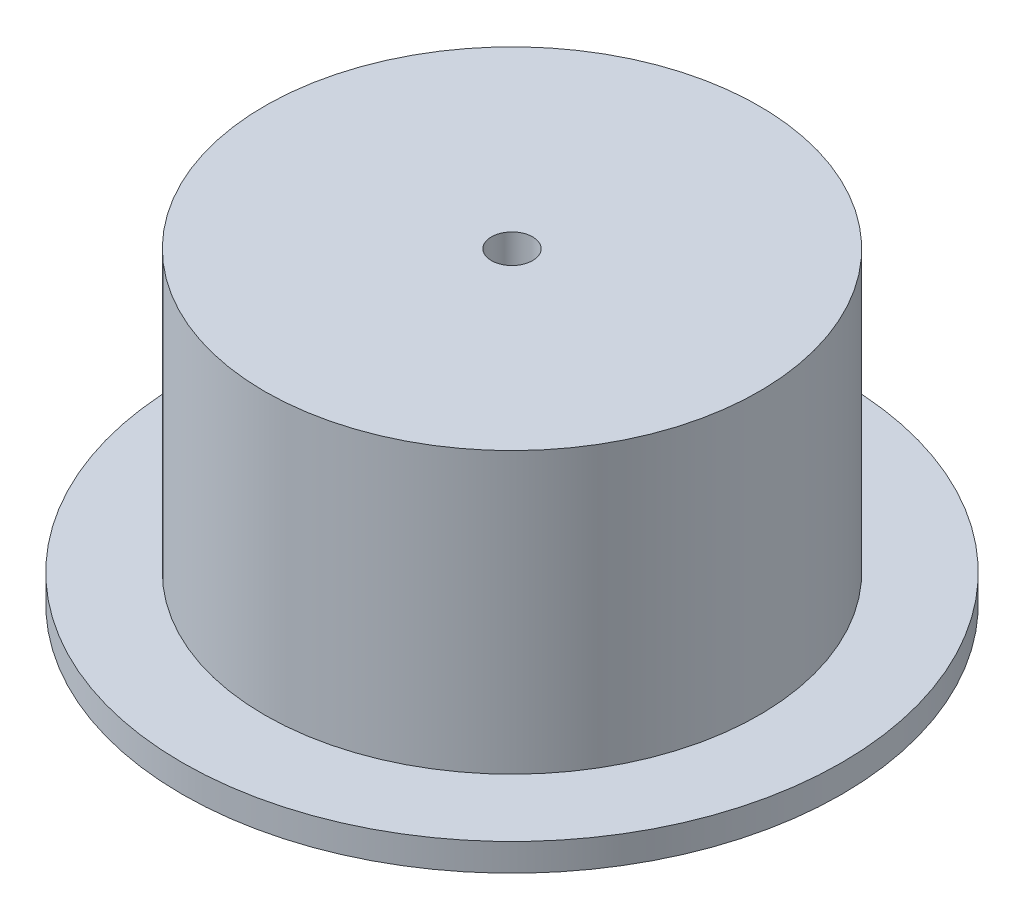
ISO-10303-21;
HEADER;
FILE_DESCRIPTION(('STEP AP214'),'2;1');
FILE_NAME('part.step','',(''),(''),'','','');
FILE_SCHEMA(('AUTOMOTIVE_DESIGN { 1 0 10303 214 1 1 1 1 }'));
ENDSEC;
DATA;
#1=APPLICATION_CONTEXT('core data for automotive mechanical design processes');
#2=APPLICATION_PROTOCOL_DEFINITION('international standard','automotive_design',2000,#1);
#3=PRODUCT_CONTEXT('',#1,'mechanical');
#4=PRODUCT('Part','Part','',(#3));
#5=PRODUCT_RELATED_PRODUCT_CATEGORY('part','',(#4));
#6=PRODUCT_DEFINITION_FORMATION('','',#4);
#7=PRODUCT_DEFINITION_CONTEXT('part definition',#1,'design');
#8=PRODUCT_DEFINITION('design','',#6,#7);
#9=PRODUCT_DEFINITION_SHAPE('','',#8);
#10=(LENGTH_UNIT() NAMED_UNIT(*) SI_UNIT(.MILLI.,.METRE.));
#11=(NAMED_UNIT(*) PLANE_ANGLE_UNIT() SI_UNIT($,.RADIAN.));
#12=(NAMED_UNIT(*) SI_UNIT($,.STERADIAN.) SOLID_ANGLE_UNIT());
#13=UNCERTAINTY_MEASURE_WITH_UNIT(LENGTH_MEASURE(1.E-05),#10,'distance_accuracy_value','');
#14=(GEOMETRIC_REPRESENTATION_CONTEXT(3) GLOBAL_UNCERTAINTY_ASSIGNED_CONTEXT((#13)) GLOBAL_UNIT_ASSIGNED_CONTEXT((#10,
#11,#12)) REPRESENTATION_CONTEXT('',''));
#15=CARTESIAN_POINT('',(0.,0.,0.));
#16=DIRECTION('',(0.,0.,1.));
#17=DIRECTION('',(1.,0.,0.));
#18=AXIS2_PLACEMENT_3D('',#15,#16,#17);
#19=CARTESIAN_POINT('',(0.,56.,0.));
#20=DIRECTION('',(0.,-1.,0.));
#21=DIRECTION('',(0.,0.,-1.));
#22=AXIS2_PLACEMENT_3D('',#19,#20,#21);
#23=CYLINDRICAL_SURFACE('',#22,40.);
#24=CARTESIAN_POINT('',(0.,0.,0.));
#25=DIRECTION('',(0.,1.,0.));
#26=DIRECTION('',(0.,0.,1.));
#27=AXIS2_PLACEMENT_3D('',#24,#25,#26);
#28=CIRCLE('',#27,40.);
#29=CARTESIAN_POINT('',(0.,0.,40.));
#30=VERTEX_POINT('',#29);
#31=EDGE_CURVE('E48',#30,#30,#28,.T.);
#32=ORIENTED_EDGE('',*,*,#31,.F.);
#33=EDGE_LOOP('',(#32));
#34=FACE_BOUND('',#33,.T.);
#35=CARTESIAN_POINT('',(0.,46.,0.));
#36=DIRECTION('',(0.,1.,0.));
#37=DIRECTION('',(0.,0.,1.));
#38=AXIS2_PLACEMENT_3D('',#35,#36,#37);
#39=CIRCLE('',#38,40.);
#40=CARTESIAN_POINT('',(0.,46.,40.));
#41=VERTEX_POINT('',#40);
#42=EDGE_CURVE('E51',#41,#41,#39,.T.);
#43=ORIENTED_EDGE('',*,*,#42,.T.);
#44=EDGE_LOOP('',(#43));
#45=FACE_BOUND('',#44,.T.);
#46=ADVANCED_FACE('F30',(#34,#45),#23,.F.);
#47=CARTESIAN_POINT('',(0.,5.,0.));
#48=DIRECTION('',(0.,1.,0.));
#49=DIRECTION('',(0.,0.,1.));
#50=AXIS2_PLACEMENT_3D('',#47,#48,#49);
#51=PLANE('',#50);
#52=CARTESIAN_POINT('',(0.,5.,0.));
#53=DIRECTION('',(0.,1.,0.));
#54=DIRECTION('',(0.,0.,1.));
#55=AXIS2_PLACEMENT_3D('',#52,#53,#54);
#56=CIRCLE('',#55,60.);
#57=CARTESIAN_POINT('',(0.,5.,60.));
#58=VERTEX_POINT('',#57);
#59=EDGE_CURVE('E10',#58,#58,#56,.T.);
#60=ORIENTED_EDGE('',*,*,#59,.T.);
#61=EDGE_LOOP('',(#60));
#62=FACE_BOUND('',#61,.T.);
#63=CARTESIAN_POINT('',(0.,5.,0.));
#64=DIRECTION('',(0.,1.,0.));
#65=DIRECTION('',(0.,0.,1.));
#66=AXIS2_PLACEMENT_3D('',#63,#64,#65);
#67=CIRCLE('',#66,45.);
#68=CARTESIAN_POINT('',(0.,5.,45.));
#69=VERTEX_POINT('',#68);
#70=EDGE_CURVE('E41',#69,#69,#67,.T.);
#71=ORIENTED_EDGE('',*,*,#70,.F.);
#72=EDGE_LOOP('',(#71));
#73=FACE_BOUND('',#72,.T.);
#74=ADVANCED_FACE('F85',(#62,#73),#51,.T.);
#75=CARTESIAN_POINT('',(0.,0.,0.));
#76=DIRECTION('',(0.,1.,0.));
#77=DIRECTION('',(0.,0.,1.));
#78=AXIS2_PLACEMENT_3D('',#75,#76,#77);
#79=PLANE('',#78);
#80=CARTESIAN_POINT('',(0.,0.,0.));
#81=DIRECTION('',(0.,1.,0.));
#82=DIRECTION('',(0.,0.,1.));
#83=AXIS2_PLACEMENT_3D('',#80,#81,#82);
#84=CIRCLE('',#83,60.);
#85=CARTESIAN_POINT('',(0.,0.,60.));
#86=VERTEX_POINT('',#85);
#87=EDGE_CURVE('E34',#86,#86,#84,.T.);
#88=ORIENTED_EDGE('',*,*,#87,.F.);
#89=EDGE_LOOP('',(#88));
#90=FACE_BOUND('',#89,.T.);
#91=ORIENTED_EDGE('',*,*,#31,.T.);
#92=EDGE_LOOP('',(#91));
#93=FACE_BOUND('',#92,.T.);
#94=ADVANCED_FACE('F81',(#90,#93),#79,.F.);
#95=CARTESIAN_POINT('',(0.,5.,0.));
#96=DIRECTION('',(0.,-1.,0.));
#97=DIRECTION('',(0.,0.,-1.));
#98=AXIS2_PLACEMENT_3D('',#95,#96,#97);
#99=CYLINDRICAL_SURFACE('',#98,60.);
#100=ORIENTED_EDGE('',*,*,#59,.F.);
#101=EDGE_LOOP('',(#100));
#102=FACE_BOUND('',#101,.T.);
#103=ORIENTED_EDGE('',*,*,#87,.T.);
#104=EDGE_LOOP('',(#103));
#105=FACE_BOUND('',#104,.T.);
#106=ADVANCED_FACE('F32',(#102,#105),#99,.T.);
#107=CARTESIAN_POINT('',(0.,56.,0.));
#108=DIRECTION('',(0.,1.,0.));
#109=DIRECTION('',(0.,0.,1.));
#110=AXIS2_PLACEMENT_3D('',#107,#108,#109);
#111=PLANE('',#110);
#112=CARTESIAN_POINT('',(0.,56.,0.));
#113=DIRECTION('',(0.,1.,0.));
#114=DIRECTION('',(0.,0.,1.));
#115=AXIS2_PLACEMENT_3D('',#112,#113,#114);
#116=CIRCLE('',#115,45.);
#117=CARTESIAN_POINT('',(0.,56.,45.));
#118=VERTEX_POINT('',#117);
#119=EDGE_CURVE('E45',#118,#118,#116,.T.);
#120=ORIENTED_EDGE('',*,*,#119,.T.);
#121=EDGE_LOOP('',(#120));
#122=FACE_BOUND('',#121,.T.);
#123=CARTESIAN_POINT('',(0.,56.,0.));
#124=DIRECTION('',(0.,1.,0.));
#125=DIRECTION('',(0.,0.,1.));
#126=AXIS2_PLACEMENT_3D('',#123,#124,#125);
#127=CIRCLE('',#126,3.75);
#128=CARTESIAN_POINT('',(0.,56.,3.75));
#129=VERTEX_POINT('',#128);
#130=EDGE_CURVE('E55',#129,#129,#127,.T.);
#131=ORIENTED_EDGE('',*,*,#130,.F.);
#132=EDGE_LOOP('',(#131));
#133=FACE_BOUND('',#132,.T.);
#134=ADVANCED_FACE('F70',(#122,#133),#111,.T.);
#135=CARTESIAN_POINT('',(0.,56.,0.));
#136=DIRECTION('',(0.,-1.,0.));
#137=DIRECTION('',(0.,0.,-1.));
#138=AXIS2_PLACEMENT_3D('',#135,#136,#137);
#139=CYLINDRICAL_SURFACE('',#138,45.);
#140=ORIENTED_EDGE('',*,*,#70,.T.);
#141=EDGE_LOOP('',(#140));
#142=FACE_BOUND('',#141,.T.);
#143=ORIENTED_EDGE('',*,*,#119,.F.);
#144=EDGE_LOOP('',(#143));
#145=FACE_BOUND('',#144,.T.);
#146=ADVANCED_FACE('F72',(#142,#145),#139,.T.);
#147=CARTESIAN_POINT('',(0.,46.,0.));
#148=DIRECTION('',(0.,1.,0.));
#149=DIRECTION('',(0.,0.,1.));
#150=AXIS2_PLACEMENT_3D('',#147,#148,#149);
#151=PLANE('',#150);
#152=CARTESIAN_POINT('',(0.,46.,0.));
#153=DIRECTION('',(0.,1.,0.));
#154=DIRECTION('',(0.,0.,1.));
#155=AXIS2_PLACEMENT_3D('',#152,#153,#154);
#156=CIRCLE('',#155,3.75);
#157=CARTESIAN_POINT('',(0.,46.,3.75));
#158=VERTEX_POINT('',#157);
#159=EDGE_CURVE('E54',#158,#158,#156,.T.);
#160=ORIENTED_EDGE('',*,*,#159,.T.);
#161=EDGE_LOOP('',(#160));
#162=FACE_BOUND('',#161,.T.);
#163=ORIENTED_EDGE('',*,*,#42,.F.);
#164=EDGE_LOOP('',(#163));
#165=FACE_BOUND('',#164,.T.);
#166=ADVANCED_FACE('F61',(#162,#165),#151,.F.);
#167=CARTESIAN_POINT('',(0.,46.,0.));
#168=DIRECTION('',(0.,1.,0.));
#169=DIRECTION('',(0.,0.,1.));
#170=AXIS2_PLACEMENT_3D('',#167,#168,#169);
#171=CYLINDRICAL_SURFACE('',#170,3.75);
#172=ORIENTED_EDGE('',*,*,#159,.F.);
#173=EDGE_LOOP('',(#172));
#174=FACE_BOUND('',#173,.T.);
#175=ORIENTED_EDGE('',*,*,#130,.T.);
#176=EDGE_LOOP('',(#175));
#177=FACE_BOUND('',#176,.T.);
#178=ADVANCED_FACE('F64',(#174,#177),#171,.F.);
#179=CLOSED_SHELL('',(#46,#74,#94,#106,#134,#146,#166,#178));
#180=MANIFOLD_SOLID_BREP('B2',#179);
#181=ADVANCED_BREP_SHAPE_REPRESENTATION('',(#18,#180),#14);
#182=SHAPE_DEFINITION_REPRESENTATION(#9,#181);
ENDSEC;
END-ISO-10303-21;
